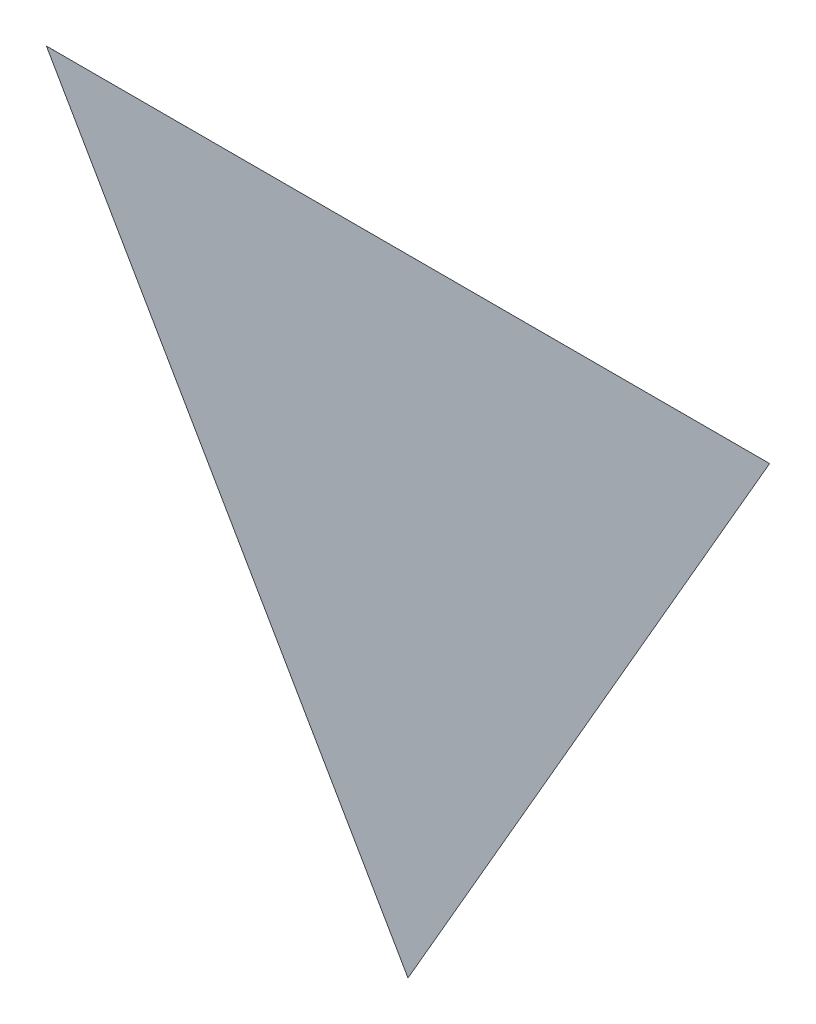
ISO-10303-21;
HEADER;
FILE_DESCRIPTION(('STEP AP214'),'2;1');
FILE_NAME('part.step','',(''),(''),'','','');
FILE_SCHEMA(('AUTOMOTIVE_DESIGN { 1 0 10303 214 1 1 1 1 }'));
ENDSEC;
DATA;
#1=APPLICATION_CONTEXT('core data for automotive mechanical design processes');
#2=APPLICATION_PROTOCOL_DEFINITION('international standard','automotive_design',2000,#1);
#3=PRODUCT_CONTEXT('',#1,'mechanical');
#4=PRODUCT('Part','Part','',(#3));
#5=PRODUCT_RELATED_PRODUCT_CATEGORY('part','',(#4));
#6=PRODUCT_DEFINITION_FORMATION('','',#4);
#7=PRODUCT_DEFINITION_CONTEXT('part definition',#1,'design');
#8=PRODUCT_DEFINITION('design','',#6,#7);
#9=PRODUCT_DEFINITION_SHAPE('','',#8);
#10=(LENGTH_UNIT() NAMED_UNIT(*) SI_UNIT(.MILLI.,.METRE.));
#11=(NAMED_UNIT(*) PLANE_ANGLE_UNIT() SI_UNIT($,.RADIAN.));
#12=(NAMED_UNIT(*) SI_UNIT($,.STERADIAN.) SOLID_ANGLE_UNIT());
#13=UNCERTAINTY_MEASURE_WITH_UNIT(LENGTH_MEASURE(1.E-05),#10,'distance_accuracy_value','');
#14=(GEOMETRIC_REPRESENTATION_CONTEXT(3) GLOBAL_UNCERTAINTY_ASSIGNED_CONTEXT((#13)) GLOBAL_UNIT_ASSIGNED_CONTEXT((#10,
#11,#12)) REPRESENTATION_CONTEXT('',''));
#15=CARTESIAN_POINT('',(0.,0.,0.));
#16=DIRECTION('',(0.,0.,1.));
#17=DIRECTION('',(1.,0.,0.));
#18=AXIS2_PLACEMENT_3D('',#15,#16,#17);
#19=CARTESIAN_POINT('',(-48.198645159069,4.35191964991458,0.0001));
#20=DIRECTION('',(0.866025403784439,0.5,0.));
#21=DIRECTION('',(-0.5,0.866025403784439,0.));
#22=AXIS2_PLACEMENT_3D('',#19,#20,#21);
#23=PLANE('',#22);
#24=DIRECTION('',(0.5,-0.866025403784439,0.));
#25=VECTOR('',#24,1.);
#26=CARTESIAN_POINT('',(-48.198645159069,4.35191964991458,0.));
#27=LINE('',#26,#25);
#28=CARTESIAN_POINT('',(-60.698645159069,26.0025547445256,0.));
#29=VERTEX_POINT('',#28);
#30=CARTESIAN_POINT('',(-48.198645159069,4.35191964991458,0.));
#31=VERTEX_POINT('',#30);
#32=EDGE_CURVE('E80',#29,#31,#27,.T.);
#33=ORIENTED_EDGE('',*,*,#32,.T.);
#34=DIRECTION('',(0.,0.,-1.));
#35=VECTOR('',#34,1.);
#36=CARTESIAN_POINT('',(-48.198645159069,4.35191964991458,0.0001));
#37=LINE('',#36,#35);
#38=CARTESIAN_POINT('',(-48.198645159069,4.35191964991458,0.0001));
#39=VERTEX_POINT('',#38);
#40=EDGE_CURVE('E11',#39,#31,#37,.T.);
#41=ORIENTED_EDGE('',*,*,#40,.F.);
#42=DIRECTION('',(0.5,-0.866025403784439,0.));
#43=VECTOR('',#42,1.);
#44=CARTESIAN_POINT('',(-48.198645159069,4.35191964991458,0.0001));
#45=LINE('',#44,#43);
#46=CARTESIAN_POINT('',(-60.698645159069,26.0025547445256,0.0001));
#47=VERTEX_POINT('',#46);
#48=EDGE_CURVE('E73',#47,#39,#45,.T.);
#49=ORIENTED_EDGE('',*,*,#48,.F.);
#50=DIRECTION('',(0.,0.,-1.));
#51=VECTOR('',#50,1.);
#52=CARTESIAN_POINT('',(-60.698645159069,26.0025547445256,0.0001));
#53=LINE('',#52,#51);
#54=EDGE_CURVE('E81',#47,#29,#53,.T.);
#55=ORIENTED_EDGE('',*,*,#54,.T.);
#56=EDGE_LOOP('',(#33,#41,#49,#55));
#57=FACE_BOUND('',#56,.T.);
#58=ADVANCED_FACE('F33',(#57),#23,.F.);
#59=CARTESIAN_POINT('',(-35.698645159069,26.0025547445256,0.0001));
#60=DIRECTION('',(-0.866025403784439,0.5,0.));
#61=DIRECTION('',(-0.5,-0.866025403784439,0.));
#62=AXIS2_PLACEMENT_3D('',#59,#60,#61);
#63=PLANE('',#62);
#64=DIRECTION('',(0.5,0.866025403784439,0.));
#65=VECTOR('',#64,1.);
#66=CARTESIAN_POINT('',(-35.698645159069,26.0025547445256,0.));
#67=LINE('',#66,#65);
#68=CARTESIAN_POINT('',(-35.698645159069,26.0025547445256,0.));
#69=VERTEX_POINT('',#68);
#70=EDGE_CURVE('E61',#31,#69,#67,.T.);
#71=ORIENTED_EDGE('',*,*,#70,.T.);
#72=DIRECTION('',(0.,0.,-1.));
#73=VECTOR('',#72,1.);
#74=CARTESIAN_POINT('',(-35.698645159069,26.0025547445256,0.0001));
#75=LINE('',#74,#73);
#76=CARTESIAN_POINT('',(-35.698645159069,26.0025547445256,0.0001));
#77=VERTEX_POINT('',#76);
#78=EDGE_CURVE('E41',#77,#69,#75,.T.);
#79=ORIENTED_EDGE('',*,*,#78,.F.);
#80=DIRECTION('',(0.5,0.866025403784439,0.));
#81=VECTOR('',#80,1.);
#82=CARTESIAN_POINT('',(-35.698645159069,26.0025547445256,0.0001));
#83=LINE('',#82,#81);
#84=EDGE_CURVE('E69',#39,#77,#83,.T.);
#85=ORIENTED_EDGE('',*,*,#84,.F.);
#86=ORIENTED_EDGE('',*,*,#40,.T.);
#87=EDGE_LOOP('',(#71,#79,#85,#86));
#88=FACE_BOUND('',#87,.T.);
#89=ADVANCED_FACE('F70',(#88),#63,.F.);
#90=CARTESIAN_POINT('',(-60.698645159069,26.0025547445256,0.0001));
#91=DIRECTION('',(0.,-1.,0.));
#92=DIRECTION('',(0.,0.,-1.));
#93=AXIS2_PLACEMENT_3D('',#90,#91,#92);
#94=PLANE('',#93);
#95=DIRECTION('',(-1.,0.,0.));
#96=VECTOR('',#95,1.);
#97=CARTESIAN_POINT('',(-60.698645159069,26.0025547445256,0.));
#98=LINE('',#97,#96);
#99=EDGE_CURVE('E66',#69,#29,#98,.T.);
#100=ORIENTED_EDGE('',*,*,#99,.T.);
#101=ORIENTED_EDGE('',*,*,#54,.F.);
#102=DIRECTION('',(-1.,0.,0.));
#103=VECTOR('',#102,1.);
#104=CARTESIAN_POINT('',(-60.698645159069,26.0025547445256,0.0001));
#105=LINE('',#104,#103);
#106=EDGE_CURVE('E49',#77,#47,#105,.T.);
#107=ORIENTED_EDGE('',*,*,#106,.F.);
#108=ORIENTED_EDGE('',*,*,#78,.T.);
#109=EDGE_LOOP('',(#100,#101,#107,#108));
#110=FACE_BOUND('',#109,.T.);
#111=ADVANCED_FACE('F88',(#110),#94,.F.);
#112=CARTESIAN_POINT('',(0.,0.,0.0001));
#113=DIRECTION('',(0.,0.,-1.));
#114=DIRECTION('',(-1.,0.,0.));
#115=AXIS2_PLACEMENT_3D('',#112,#113,#114);
#116=PLANE('',#115);
#117=ORIENTED_EDGE('',*,*,#48,.T.);
#118=ORIENTED_EDGE('',*,*,#84,.T.);
#119=ORIENTED_EDGE('',*,*,#106,.T.);
#120=EDGE_LOOP('',(#117,#118,#119));
#121=FACE_BOUND('',#120,.T.);
#122=ADVANCED_FACE('F76',(#121),#116,.F.);
#123=CARTESIAN_POINT('',(0.,0.,0.));
#124=DIRECTION('',(0.,0.,-1.));
#125=DIRECTION('',(-1.,0.,0.));
#126=AXIS2_PLACEMENT_3D('',#123,#124,#125);
#127=PLANE('',#126);
#128=ORIENTED_EDGE('',*,*,#32,.F.);
#129=ORIENTED_EDGE('',*,*,#99,.F.);
#130=ORIENTED_EDGE('',*,*,#70,.F.);
#131=EDGE_LOOP('',(#128,#129,#130));
#132=FACE_BOUND('',#131,.T.);
#133=ADVANCED_FACE('F89',(#132),#127,.T.);
#134=CLOSED_SHELL('',(#58,#89,#111,#122,#133));
#135=MANIFOLD_SOLID_BREP('B2',#134);
#136=ADVANCED_BREP_SHAPE_REPRESENTATION('',(#18,#135),#14);
#137=SHAPE_DEFINITION_REPRESENTATION(#9,#136);
ENDSEC;
END-ISO-10303-21;
